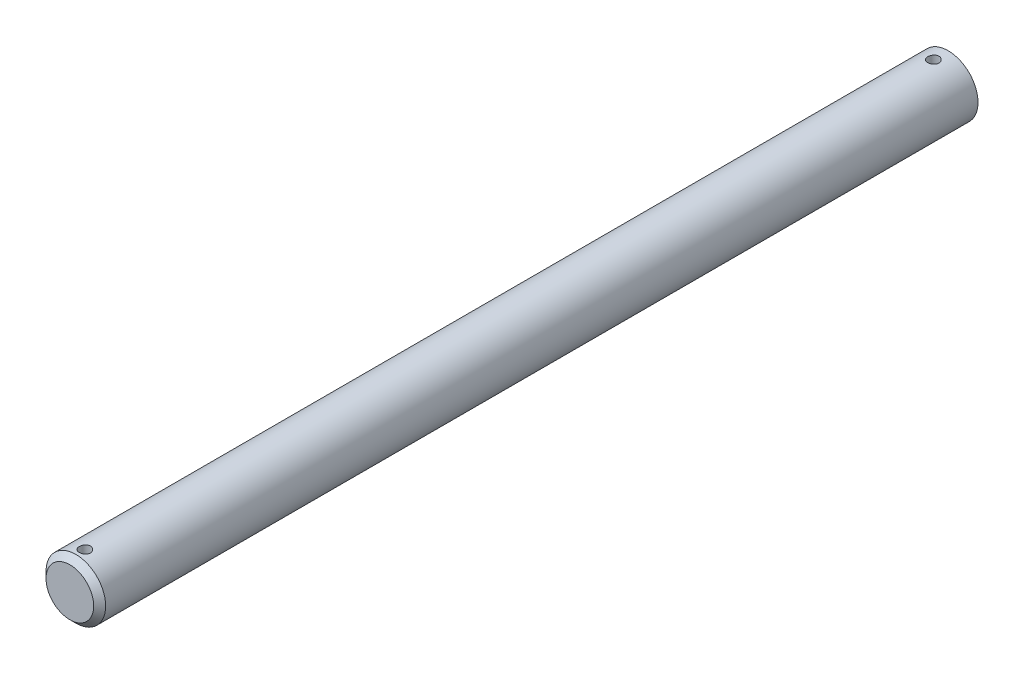
ISO-10303-21;
HEADER;
FILE_DESCRIPTION(('STEP AP214'),'2;1');
FILE_NAME('part.step','',(''),(''),'','','');
FILE_SCHEMA(('AUTOMOTIVE_DESIGN { 1 0 10303 214 1 1 1 1 }'));
ENDSEC;
DATA;
#1=APPLICATION_CONTEXT('core data for automotive mechanical design processes');
#2=APPLICATION_PROTOCOL_DEFINITION('international standard','automotive_design',2000,#1);
#3=PRODUCT_CONTEXT('',#1,'mechanical');
#4=PRODUCT('Part','Part','',(#3));
#5=PRODUCT_RELATED_PRODUCT_CATEGORY('part','',(#4));
#6=PRODUCT_DEFINITION_FORMATION('','',#4);
#7=PRODUCT_DEFINITION_CONTEXT('part definition',#1,'design');
#8=PRODUCT_DEFINITION('design','',#6,#7);
#9=PRODUCT_DEFINITION_SHAPE('','',#8);
#10=(LENGTH_UNIT() NAMED_UNIT(*) SI_UNIT(.MILLI.,.METRE.));
#11=(NAMED_UNIT(*) PLANE_ANGLE_UNIT() SI_UNIT($,.RADIAN.));
#12=(NAMED_UNIT(*) SI_UNIT($,.STERADIAN.) SOLID_ANGLE_UNIT());
#13=UNCERTAINTY_MEASURE_WITH_UNIT(LENGTH_MEASURE(1.E-05),#10,'distance_accuracy_value','');
#14=(GEOMETRIC_REPRESENTATION_CONTEXT(3) GLOBAL_UNCERTAINTY_ASSIGNED_CONTEXT((#13)) GLOBAL_UNIT_ASSIGNED_CONTEXT((#10,
#11,#12)) REPRESENTATION_CONTEXT('',''));
#15=CARTESIAN_POINT('',(0.,0.,0.));
#16=DIRECTION('',(0.,0.,1.));
#17=DIRECTION('',(1.,0.,0.));
#18=AXIS2_PLACEMENT_3D('',#15,#16,#17);
#19=CARTESIAN_POINT('',(0.,0.,304.8));
#20=DIRECTION('',(0.,0.,-1.));
#21=DIRECTION('',(-1.,0.,0.));
#22=AXIS2_PLACEMENT_3D('',#19,#20,#21);
#23=CYLINDRICAL_SURFACE('',#22,3.175);
#24=CARTESIAN_POINT('',(0.,-3.17500000000001,213.4631875));
#25=CARTESIAN_POINT('',(0.0331278493784859,-3.17499940005936,213.463186234132));
#26=CARTESIAN_POINT('',(0.0662721689897613,-3.17447616437681,213.460412916467));
#27=CARTESIAN_POINT('',(0.131626820280968,-3.17243930650301,213.449400064437));
#28=CARTESIAN_POINT('',(0.163836339741669,-3.17092484847488,213.441155916777));
#29=CARTESIAN_POINT('',(0.226366769234938,-3.16707495697542,213.419462709188));
#30=CARTESIAN_POINT('',(0.25668935624075,-3.16474026510011,213.406018349808));
#31=CARTESIAN_POINT('',(0.314645664321689,-3.1595048514429,213.374319695721));
#32=CARTESIAN_POINT('',(0.342279602808194,-3.1566041754851,213.356065790371));
#33=CARTESIAN_POINT('',(0.394407912259928,-3.15051811645857,213.315034154574));
#34=CARTESIAN_POINT('',(0.418865429028271,-3.14733001333615,213.292210001647));
#35=CARTESIAN_POINT('',(0.463627811849759,-3.14104860763278,213.242785624206));
#36=CARTESIAN_POINT('',(0.483932379579189,-3.13795531187579,213.216185128654));
#37=CARTESIAN_POINT('',(0.51996577595488,-3.13218731275362,213.159702708681));
#38=CARTESIAN_POINT('',(0.535657115316888,-3.12951611636079,213.12979647803));
#39=CARTESIAN_POINT('',(0.561778643443762,-3.12493308056008,213.067713899289));
#40=CARTESIAN_POINT('',(0.572209285923869,-3.1230211756692,213.035537747243));
#41=CARTESIAN_POINT('',(0.587395056092026,-3.120200569874,212.970223017731));
#42=CARTESIAN_POINT('',(0.592214454824667,-3.11928051754792,212.937099883297));
#43=CARTESIAN_POINT('',(0.59624042587842,-3.11851356370003,212.870503350404));
#44=CARTESIAN_POINT('',(0.595447501537279,-3.11866656594196,212.837029983624));
#45=CARTESIAN_POINT('',(0.588323450296888,-3.12001809916009,212.77114881341));
#46=CARTESIAN_POINT('',(0.582065407796817,-3.12120283233474,212.738732782137));
#47=CARTESIAN_POINT('',(0.564303860103714,-3.12446266491103,212.675419033399));
#48=CARTESIAN_POINT('',(0.552800132013031,-3.12653780214715,212.644521380514));
#49=CARTESIAN_POINT('',(0.524802287242863,-3.13135905069247,212.584907618022));
#50=CARTESIAN_POINT('',(0.50827865995695,-3.13410911079899,212.556205700738));
#51=CARTESIAN_POINT('',(0.470730932942599,-3.13996773104909,212.501954373361));
#52=CARTESIAN_POINT('',(0.44970637646678,-3.14307632756161,212.476405283626));
#53=CARTESIAN_POINT('',(0.403359563188534,-3.14936188004891,212.428762595718));
#54=CARTESIAN_POINT('',(0.377974795254099,-3.15253914125163,212.406729803558));
#55=CARTESIAN_POINT('',(0.32383731472362,-3.15855900111739,212.367226220107));
#56=CARTESIAN_POINT('',(0.295084568364031,-3.16140159642489,212.349755474555));
#57=CARTESIAN_POINT('',(0.234963886209654,-3.16643757934512,212.319862953933));
#58=CARTESIAN_POINT('',(0.20359273338972,-3.16863015282215,212.307447503288));
#59=CARTESIAN_POINT('',(0.13915989892387,-3.17211275581705,212.288079481804));
#60=CARTESIAN_POINT('',(0.106098397260255,-3.17340288121049,212.281126330644));
#61=CARTESIAN_POINT('',(0.0397464966210355,-3.17492205629787,212.27296491894));
#62=CARTESIAN_POINT('',(0.0064666862641764,-3.17516649268312,212.271673344612));
#63=CARTESIAN_POINT('',(-0.0598333703365833,-3.17460925115548,212.274648268445));
#64=CARTESIAN_POINT('',(-0.0928536292531519,-3.1738076246401,212.278914493529));
#65=CARTESIAN_POINT('',(-0.157432999370982,-3.17125791126725,212.292814648338));
#66=CARTESIAN_POINT('',(-0.189001503602659,-3.16951726067194,212.302406421507));
#67=CARTESIAN_POINT('',(-0.250082300755404,-3.16528387378086,212.326639777378));
#68=CARTESIAN_POINT('',(-0.279594453904932,-3.16279108642312,212.34128170294));
#69=CARTESIAN_POINT('',(-0.336080366506809,-3.157291557982,212.375384132113));
#70=CARTESIAN_POINT('',(-0.363022863065383,-3.1542794982553,212.394895543107));
#71=CARTESIAN_POINT('',(-0.413281147045625,-3.1480892694748,212.438114198266));
#72=CARTESIAN_POINT('',(-0.43659659543635,-3.14491108492986,212.461821834222));
#73=CARTESIAN_POINT('',(-0.479255517992203,-3.13869576292426,212.513137139068));
#74=CARTESIAN_POINT('',(-0.498542136242496,-3.1356610588829,212.540792416662));
#75=CARTESIAN_POINT('',(-0.532196179135613,-3.1301252865148,212.598999182233));
#76=CARTESIAN_POINT('',(-0.546563786592779,-3.12762419835761,212.629550562522));
#77=CARTESIAN_POINT('',(-0.569891360504029,-3.12345793983175,212.692537953562));
#78=CARTESIAN_POINT('',(-0.578877385529318,-3.12178874798387,212.724964035013));
#79=CARTESIAN_POINT('',(-0.591267071076007,-3.11946609009084,212.790899991438));
#80=CARTESIAN_POINT('',(-0.594671361418134,-3.11881250944861,212.824409743701));
#81=CARTESIAN_POINT('',(-0.595779868526295,-3.11860088672157,212.890992306541));
#82=CARTESIAN_POINT('',(-0.593573770795147,-3.11902560714798,212.924063602442));
#83=CARTESIAN_POINT('',(-0.583720477284632,-3.12088450886938,212.989355033124));
#84=CARTESIAN_POINT('',(-0.576073314010797,-3.12231868413375,213.021575172988));
#85=CARTESIAN_POINT('',(-0.555592803846087,-3.126027641217,213.084201436153));
#86=CARTESIAN_POINT('',(-0.542769168607854,-3.12830084823627,213.11461083469));
#87=CARTESIAN_POINT('',(-0.512309542245323,-3.13343285059637,213.172860838402));
#88=CARTESIAN_POINT('',(-0.494673211138131,-3.13629168730423,213.20070126191));
#89=CARTESIAN_POINT('',(-0.454777027878801,-3.14232633736512,213.253472273017));
#90=CARTESIAN_POINT('',(-0.432451906336469,-3.1455062556199,213.278353054363));
#91=CARTESIAN_POINT('',(-0.383947958425857,-3.15179405961499,213.324045173853));
#92=CARTESIAN_POINT('',(-0.357768247938248,-3.15490192863972,213.344855575827));
#93=CARTESIAN_POINT('',(-0.30201590007541,-3.1607282796232,213.381991221824));
#94=CARTESIAN_POINT('',(-0.272414837535462,-3.1634430039313,213.398274398182));
#95=CARTESIAN_POINT('',(-0.210855763856366,-3.16814048941711,213.425610437028));
#96=CARTESIAN_POINT('',(-0.178899999270519,-3.17012393770744,213.436668212109));
#97=CARTESIAN_POINT('',(-0.122375296121231,-3.17273102874592,213.45099443416));
#98=CARTESIAN_POINT('',(-0.0981367934437096,-3.17357708754789,213.455559018905));
#99=CARTESIAN_POINT('',(-0.0492685574488275,-3.17471178919249,213.461655984027));
#100=CARTESIAN_POINT('',(-0.0246388340934183,-3.1750004462058,213.463188441489));
#101=CARTESIAN_POINT('',(0.,-3.17500000000001,213.4631875));
#102=B_SPLINE_CURVE_WITH_KNOTS('',3,(#24,#25,#26,#27,#28,#29,#30,#31,#32,#33,#34,#35,#36,#37,
#38,#39,#40,#41,#42,#43,#44,#45,#46,#47,#48,#49,#50,#51,#52,#53,#54,#55,#56,#57,#58,#59,#60,#61,
#62,#63,#64,#65,#66,#67,#68,#69,#70,#71,#72,#73,#74,#75,#76,#77,#78,#79,#80,#81,#82,#83,#84,#85,
#86,#87,#88,#89,#90,#91,#92,#93,#94,#95,#96,#97,#98,#99,#100,#101),.UNSPECIFIED.,.T.,.F.,(4,2,2,
2,2,2,2,2,2,2,2,2,2,2,2,2,2,2,2,2,2,2,2,2,2,2,2,2,2,2,2,2,2,2,2,2,2,2,4),(0.,0.0992934422579594,
0.198670720631257,0.297958379519775,0.397238003055786,0.497582499616611,0.59793420181311,
0.699080193564204,0.800217460363053,0.900184538548684,1.00014265136194,1.0987841586819,
1.19742985782943,1.29666707356097,1.3959143645104,1.4967258310918,1.59753830838152,
1.69847652240176,1.79940401117395,1.89884119086454,1.99827348496884,2.09692967832173,
2.19559257087285,2.29533361900781,2.39508398463951,2.49615895304341,2.59723016460249,
2.69780792915495,2.79837434413153,2.89734328229484,2.99631162921166,3.09509515682433,
3.19388566460125,3.29415524955412,3.39444786907214,3.49564344413668,3.59674369125816,
3.67059505483131,3.74444454087574),.UNSPECIFIED.);
#103=CARTESIAN_POINT('',(0.,-3.17500000000001,213.4631875));
#104=VERTEX_POINT('',#103);
#105=EDGE_CURVE('E10',#104,#104,#102,.T.);
#106=ORIENTED_EDGE('',*,*,#105,.T.);
#107=EDGE_LOOP('',(#106));
#108=FACE_BOUND('',#107,.T.);
#109=CARTESIAN_POINT('',(0.,3.17499999999999,213.4631875));
#110=CARTESIAN_POINT('',(-0.0331278493784851,3.17499940005934,213.463186234132));
#111=CARTESIAN_POINT('',(-0.0662721689897604,3.1744761643768,213.460412916467));
#112=CARTESIAN_POINT('',(-0.131626820280967,3.17243930650299,213.449400064437));
#113=CARTESIAN_POINT('',(-0.163836339741668,3.17092484847486,213.441155916777));
#114=CARTESIAN_POINT('',(-0.226366769234937,3.1670749569754,213.419462709188));
#115=CARTESIAN_POINT('',(-0.256689356240749,3.16474026510009,213.406018349808));
#116=CARTESIAN_POINT('',(-0.314645664321688,3.15950485144288,213.374319695721));
#117=CARTESIAN_POINT('',(-0.342279602808193,3.15660417548508,213.356065790371));
#118=CARTESIAN_POINT('',(-0.394407912259927,3.15051811645855,213.315034154574));
#119=CARTESIAN_POINT('',(-0.41886542902827,3.14733001333613,213.292210001647));
#120=CARTESIAN_POINT('',(-0.463627811849758,3.14104860763276,213.242785624206));
#121=CARTESIAN_POINT('',(-0.483932379579188,3.13795531187577,213.216185128654));
#122=CARTESIAN_POINT('',(-0.519965775954879,3.1321873127536,213.159702708681));
#123=CARTESIAN_POINT('',(-0.535657115316888,3.12951611636077,213.12979647803));
#124=CARTESIAN_POINT('',(-0.561778643443761,3.12493308056006,213.067713899289));
#125=CARTESIAN_POINT('',(-0.572209285923868,3.12302117566918,213.035537747243));
#126=CARTESIAN_POINT('',(-0.587395056092025,3.12020056987398,212.970223017731));
#127=CARTESIAN_POINT('',(-0.592214454824666,3.11928051754791,212.937099883297));
#128=CARTESIAN_POINT('',(-0.596240425878419,3.11851356370001,212.870503350404));
#129=CARTESIAN_POINT('',(-0.595447501537279,3.11866656594194,212.837029983624));
#130=CARTESIAN_POINT('',(-0.588323450296887,3.12001809916007,212.77114881341));
#131=CARTESIAN_POINT('',(-0.582065407796816,3.12120283233472,212.738732782137));
#132=CARTESIAN_POINT('',(-0.564303860103713,3.12446266491101,212.675419033399));
#133=CARTESIAN_POINT('',(-0.55280013201303,3.12653780214713,212.644521380514));
#134=CARTESIAN_POINT('',(-0.524802287242862,3.13135905069245,212.584907618022));
#135=CARTESIAN_POINT('',(-0.508278659956949,3.13410911079897,212.556205700738));
#136=CARTESIAN_POINT('',(-0.470730932942598,3.13996773104907,212.501954373361));
#137=CARTESIAN_POINT('',(-0.449706376466779,3.14307632756159,212.476405283626));
#138=CARTESIAN_POINT('',(-0.403359563188533,3.14936188004889,212.428762595718));
#139=CARTESIAN_POINT('',(-0.377974795254099,3.15253914125161,212.406729803558));
#140=CARTESIAN_POINT('',(-0.323837314723619,3.15855900111738,212.367226220107));
#141=CARTESIAN_POINT('',(-0.29508456836403,3.16140159642487,212.349755474555));
#142=CARTESIAN_POINT('',(-0.234963886209653,3.1664375793451,212.319862953933));
#143=CARTESIAN_POINT('',(-0.203592733389719,3.16863015282214,212.307447503288));
#144=CARTESIAN_POINT('',(-0.139159898923869,3.17211275581703,212.288079481804));
#145=CARTESIAN_POINT('',(-0.106098397260254,3.17340288121047,212.281126330644));
#146=CARTESIAN_POINT('',(-0.0397464966210345,3.17492205629785,212.27296491894));
#147=CARTESIAN_POINT('',(-0.00646668626417531,3.1751664926831,212.271673344612));
#148=CARTESIAN_POINT('',(0.0598333703365844,3.17460925115546,212.274648268445));
#149=CARTESIAN_POINT('',(0.0928536292531529,3.17380762464008,212.278914493529));
#150=CARTESIAN_POINT('',(0.157432999370982,3.17125791126723,212.292814648338));
#151=CARTESIAN_POINT('',(0.18900150360266,3.16951726067193,212.302406421507));
#152=CARTESIAN_POINT('',(0.250082300755404,3.16528387378084,212.326639777378));
#153=CARTESIAN_POINT('',(0.279594453904933,3.1627910864231,212.34128170294));
#154=CARTESIAN_POINT('',(0.33608036650681,3.15729155798198,212.375384132113));
#155=CARTESIAN_POINT('',(0.363022863065383,3.15427949825529,212.394895543107));
#156=CARTESIAN_POINT('',(0.413281147045626,3.14808926947478,212.438114198266));
#157=CARTESIAN_POINT('',(0.436596595436351,3.14491108492984,212.461821834222));
#158=CARTESIAN_POINT('',(0.479255517992204,3.13869576292424,212.513137139068));
#159=CARTESIAN_POINT('',(0.498542136242497,3.13566105888288,212.540792416662));
#160=CARTESIAN_POINT('',(0.532196179135614,3.13012528651479,212.598999182233));
#161=CARTESIAN_POINT('',(0.54656378659278,3.12762419835759,212.629550562522));
#162=CARTESIAN_POINT('',(0.569891360504029,3.12345793983173,212.692537953562));
#163=CARTESIAN_POINT('',(0.578877385529319,3.12178874798385,212.724964035013));
#164=CARTESIAN_POINT('',(0.591267071076008,3.11946609009082,212.790899991438));
#165=CARTESIAN_POINT('',(0.594671361418135,3.11881250944859,212.824409743701));
#166=CARTESIAN_POINT('',(0.595779868526295,3.11860088672155,212.890992306541));
#167=CARTESIAN_POINT('',(0.593573770795148,3.11902560714797,212.924063602442));
#168=CARTESIAN_POINT('',(0.583720477284633,3.12088450886936,212.989355033124));
#169=CARTESIAN_POINT('',(0.576073314010798,3.12231868413373,213.021575172988));
#170=CARTESIAN_POINT('',(0.555592803846088,3.12602764121698,213.084201436153));
#171=CARTESIAN_POINT('',(0.542769168607855,3.12830084823626,213.11461083469));
#172=CARTESIAN_POINT('',(0.512309542245323,3.13343285059635,213.172860838402));
#173=CARTESIAN_POINT('',(0.494673211138132,3.13629168730421,213.20070126191));
#174=CARTESIAN_POINT('',(0.454777027878801,3.1423263373651,213.253472273017));
#175=CARTESIAN_POINT('',(0.43245190633647,3.14550625561988,213.278353054363));
#176=CARTESIAN_POINT('',(0.383947958425858,3.15179405961497,213.324045173853));
#177=CARTESIAN_POINT('',(0.357768247938248,3.1549019286397,213.344855575827));
#178=CARTESIAN_POINT('',(0.302015900075414,3.16072827962318,213.381991221824));
#179=CARTESIAN_POINT('',(0.27241483753547,3.16344300393128,213.398274398182));
#180=CARTESIAN_POINT('',(0.210855763856375,3.16814048941709,213.425610437028));
#181=CARTESIAN_POINT('',(0.178899999270524,3.17012393770742,213.436668212109));
#182=CARTESIAN_POINT('',(0.122375296121231,3.17273102874591,213.45099443416));
#183=CARTESIAN_POINT('',(0.0981367934437104,3.17357708754787,213.455559018905));
#184=CARTESIAN_POINT('',(0.0492685574488284,3.17471178919247,213.461655984027));
#185=CARTESIAN_POINT('',(0.0246388340934192,3.17500044620578,213.463188441489));
#186=CARTESIAN_POINT('',(0.,3.17499999999999,213.4631875));
#187=B_SPLINE_CURVE_WITH_KNOTS('',3,(#109,#110,#111,#112,#113,#114,#115,#116,#117,#118,#119,
#120,#121,#122,#123,#124,#125,#126,#127,#128,#129,#130,#131,#132,#133,#134,#135,#136,#137,#138,
#139,#140,#141,#142,#143,#144,#145,#146,#147,#148,#149,#150,#151,#152,#153,#154,#155,#156,#157,
#158,#159,#160,#161,#162,#163,#164,#165,#166,#167,#168,#169,#170,#171,#172,#173,#174,#175,#176,
#177,#178,#179,#180,#181,#182,#183,#184,#185,#186),.UNSPECIFIED.,.T.,.F.,(4,2,2,2,2,2,2,2,2,2,2,
2,2,2,2,2,2,2,2,2,2,2,2,2,2,2,2,2,2,2,2,2,2,2,2,2,2,2,4),(0.,0.0992934422579594,
0.198670720631257,0.297958379519775,0.397238003055786,0.497582499616611,0.59793420181311,
0.699080193564204,0.800217460363053,0.900184538548684,1.00014265136194,1.0987841586819,
1.19742985782943,1.29666707356097,1.3959143645104,1.4967258310918,1.59753830838152,
1.69847652240176,1.79940401117395,1.89884119086454,1.99827348496884,2.09692967832173,
2.19559257087285,2.29533361900781,2.39508398463951,2.49615895304341,2.59723016460249,
2.69780792915495,2.79837434413153,2.89734328229484,2.99631162921166,3.09509515682433,
3.19388566460125,3.29415524955412,3.39444786907214,3.49564344413668,3.59674369125816,
3.67059505483131,3.74444454087574),.UNSPECIFIED.);
#188=CARTESIAN_POINT('',(0.,3.17499999999999,213.4631875));
#189=VERTEX_POINT('',#188);
#190=EDGE_CURVE('E50',#189,#189,#187,.T.);
#191=ORIENTED_EDGE('',*,*,#190,.T.);
#192=EDGE_LOOP('',(#191));
#193=FACE_BOUND('',#192,.T.);
#194=CARTESIAN_POINT('',(0.,-3.17500000000001,303.8078125));
#195=CARTESIAN_POINT('',(0.0331278493784956,-3.17499940005936,303.807811234132));
#196=CARTESIAN_POINT('',(0.0662721689897699,-3.17447616437681,303.805037916467));
#197=CARTESIAN_POINT('',(0.131626820280976,-3.17243930650301,303.794025064437));
#198=CARTESIAN_POINT('',(0.163836339741677,-3.17092484847488,303.785780916777));
#199=CARTESIAN_POINT('',(0.226366769234958,-3.16707495697542,303.764087709188));
#200=CARTESIAN_POINT('',(0.256689356240781,-3.16474026510011,303.750643349808));
#201=CARTESIAN_POINT('',(0.314645664321714,-3.15950485144289,303.718944695721));
#202=CARTESIAN_POINT('',(0.342279602808203,-3.15660417548509,303.700690790371));
#203=CARTESIAN_POINT('',(0.394407912259931,-3.15051811645857,303.659659154574));
#204=CARTESIAN_POINT('',(0.41886542902828,-3.14733001333615,303.636835001646));
#205=CARTESIAN_POINT('',(0.463627811849776,-3.14104860763277,303.587410624206));
#206=CARTESIAN_POINT('',(0.483932379579207,-3.13795531187578,303.560810128654));
#207=CARTESIAN_POINT('',(0.519965775954901,-3.13218731275362,303.504327708681));
#208=CARTESIAN_POINT('',(0.535657115316909,-3.12951611636079,303.47442147803));
#209=CARTESIAN_POINT('',(0.561778643443776,-3.12493308056008,303.412338899289));
#210=CARTESIAN_POINT('',(0.572209285923881,-3.1230211756692,303.380162747243));
#211=CARTESIAN_POINT('',(0.587395056092034,-3.120200569874,303.314848017731));
#212=CARTESIAN_POINT('',(0.592214454824669,-3.11928051754792,303.281724883297));
#213=CARTESIAN_POINT('',(0.596240425878417,-3.11851356370003,303.215128350404));
#214=CARTESIAN_POINT('',(0.595447501537278,-3.11866656594196,303.181654983624));
#215=CARTESIAN_POINT('',(0.58832345029689,-3.12001809916009,303.11577381341));
#216=CARTESIAN_POINT('',(0.582065407796815,-3.12120283233474,303.083357782137));
#217=CARTESIAN_POINT('',(0.564303860103707,-3.12446266491103,303.020044033399));
#218=CARTESIAN_POINT('',(0.552800132013023,-3.12653780214715,302.989146380513));
#219=CARTESIAN_POINT('',(0.524802287242861,-3.13135905069247,302.929532618022));
#220=CARTESIAN_POINT('',(0.508278659956958,-3.13410911079899,302.900830700738));
#221=CARTESIAN_POINT('',(0.470730932942623,-3.13996773104909,302.846579373361));
#222=CARTESIAN_POINT('',(0.449706376466809,-3.14307632756161,302.821030283626));
#223=CARTESIAN_POINT('',(0.403359563188558,-3.14936188004891,302.773387595718));
#224=CARTESIAN_POINT('',(0.377974795254109,-3.15253914125163,302.751354803558));
#225=CARTESIAN_POINT('',(0.323837314723599,-3.1585590011174,302.711851220107));
#226=CARTESIAN_POINT('',(0.295084568363997,-3.16140159642489,302.694380474555));
#227=CARTESIAN_POINT('',(0.234963886209613,-3.16643757934512,302.664487953933));
#228=CARTESIAN_POINT('',(0.203592733389688,-3.16863015282216,302.652072503288));
#229=CARTESIAN_POINT('',(0.139159898923856,-3.17211275581705,302.632704481804));
#230=CARTESIAN_POINT('',(0.106098397260251,-3.17340288121049,302.625751330645));
#231=CARTESIAN_POINT('',(0.0397464966210445,-3.17492205629787,302.61758991894));
#232=CARTESIAN_POINT('',(0.00646668626418795,-3.17516649268312,302.616298344612));
#233=CARTESIAN_POINT('',(-0.0598333703365708,-3.17460925115548,302.619273268446));
#234=CARTESIAN_POINT('',(-0.0928536292531409,-3.1738076246401,302.623539493529));
#235=CARTESIAN_POINT('',(-0.157432999370963,-3.17125791126725,302.637439648338));
#236=CARTESIAN_POINT('',(-0.189001503602631,-3.16951726067195,302.647031421507));
#237=CARTESIAN_POINT('',(-0.250082300755378,-3.16528387378086,302.671264777378));
#238=CARTESIAN_POINT('',(-0.279594453904919,-3.16279108642312,302.68590670294));
#239=CARTESIAN_POINT('',(-0.33608036650679,-3.157291557982,302.720009132113));
#240=CARTESIAN_POINT('',(-0.363022863065345,-3.15427949825531,302.739520543107));
#241=CARTESIAN_POINT('',(-0.413281147045584,-3.14808926947481,302.782739198266));
#242=CARTESIAN_POINT('',(-0.436596595436325,-3.14491108492986,302.806446834222));
#243=CARTESIAN_POINT('',(-0.479255517992183,-3.13869576292427,302.857762139068));
#244=CARTESIAN_POINT('',(-0.498542136242465,-3.13566105888291,302.885417416662));
#245=CARTESIAN_POINT('',(-0.532196179135576,-3.13012528651481,302.943624182233));
#246=CARTESIAN_POINT('',(-0.546563786592745,-3.12762419835762,302.974175562522));
#247=CARTESIAN_POINT('',(-0.569891360503998,-3.12345793983176,303.037162953562));
#248=CARTESIAN_POINT('',(-0.578877385529289,-3.12178874798387,303.069589035013));
#249=CARTESIAN_POINT('',(-0.591267071075983,-3.11946609009085,303.135524991438));
#250=CARTESIAN_POINT('',(-0.594671361418111,-3.11881250944861,303.169034743701));
#251=CARTESIAN_POINT('',(-0.595779868526272,-3.11860088672157,303.235617306541));
#252=CARTESIAN_POINT('',(-0.593573770795127,-3.11902560714799,303.268688602442));
#253=CARTESIAN_POINT('',(-0.583720477284618,-3.12088450886938,303.333980033124));
#254=CARTESIAN_POINT('',(-0.57607331401078,-3.12231868413375,303.366200172988));
#255=CARTESIAN_POINT('',(-0.555592803846065,-3.12602764121701,303.428826436153));
#256=CARTESIAN_POINT('',(-0.542769168607834,-3.12830084823628,303.45923583469));
#257=CARTESIAN_POINT('',(-0.512309542245301,-3.13343285059638,303.517485838402));
#258=CARTESIAN_POINT('',(-0.4946732111381,-3.13629168730423,303.54532626191));
#259=CARTESIAN_POINT('',(-0.454777027878766,-3.14232633736512,303.598097273017));
#260=CARTESIAN_POINT('',(-0.432451906336444,-3.1455062556199,303.622978054363));
#261=CARTESIAN_POINT('',(-0.383947958425829,-3.15179405961499,303.668670173853));
#262=CARTESIAN_POINT('',(-0.357768247938207,-3.15490192863972,303.689480575826));
#263=CARTESIAN_POINT('',(-0.302015900075373,-3.16072827962321,303.726616221824));
#264=CARTESIAN_POINT('',(-0.272414837535442,-3.1634430039313,303.742899398182));
#265=CARTESIAN_POINT('',(-0.21085576385636,-3.16814048941711,303.770235437028));
#266=CARTESIAN_POINT('',(-0.178899999270509,-3.17012393770744,303.781293212109));
#267=CARTESIAN_POINT('',(-0.122375296121215,-3.17273102874592,303.79561943416));
#268=CARTESIAN_POINT('',(-0.0981367934436929,-3.17357708754789,303.800184018905));
#269=CARTESIAN_POINT('',(-0.0492685574488116,-3.17471178919249,303.806280984027));
#270=CARTESIAN_POINT('',(-0.0246388340934046,-3.1750004462058,303.807813441489));
#271=CARTESIAN_POINT('',(0.,-3.17500000000001,303.8078125));
#272=B_SPLINE_CURVE_WITH_KNOTS('',3,(#194,#195,#196,#197,#198,#199,#200,#201,#202,#203,#204,
#205,#206,#207,#208,#209,#210,#211,#212,#213,#214,#215,#216,#217,#218,#219,#220,#221,#222,#223,
#224,#225,#226,#227,#228,#229,#230,#231,#232,#233,#234,#235,#236,#237,#238,#239,#240,#241,#242,
#243,#244,#245,#246,#247,#248,#249,#250,#251,#252,#253,#254,#255,#256,#257,#258,#259,#260,#261,
#262,#263,#264,#265,#266,#267,#268,#269,#270,#271),.UNSPECIFIED.,.T.,.F.,(4,2,2,2,2,2,2,2,2,2,2,
2,2,2,2,2,2,2,2,2,2,2,2,2,2,2,2,2,2,2,2,2,2,2,2,2,2,2,4),(0.,0.0992934422579537,
0.198670720631256,0.297958379519797,0.397238003055775,0.497582499616633,0.597934201813132,
0.699080193564254,0.800217460363045,0.900184538548675,1.00014265136191,1.09878415868192,
1.19742985782948,1.29666707356095,1.39591436451032,1.49672583109181,1.59753830838155,
1.69847652240177,1.79940401117393,1.89884119086451,1.99827348496881,2.09692967832168,
2.1955925708728,2.29533361900778,2.39508398463947,2.49615895304333,2.59723016460242,
2.69780792915486,2.79837434413146,2.89734328229474,2.99631162921161,3.09509515682426,
3.19388566460124,3.29415524955408,3.39444786907209,3.49564344413663,3.5967436912581,
3.67059505483126,3.74444454087568),.UNSPECIFIED.);
#273=CARTESIAN_POINT('',(0.,-3.17500000000001,303.8078125));
#274=VERTEX_POINT('',#273);
#275=EDGE_CURVE('E56',#274,#274,#272,.T.);
#276=ORIENTED_EDGE('',*,*,#275,.T.);
#277=EDGE_LOOP('',(#276));
#278=FACE_BOUND('',#277,.T.);
#279=CARTESIAN_POINT('',(0.,3.17499999999999,303.8078125));
#280=CARTESIAN_POINT('',(-0.0331278493784698,3.17499940005934,303.807811234132));
#281=CARTESIAN_POINT('',(-0.0662721689897442,3.17447616437679,303.805037916467));
#282=CARTESIAN_POINT('',(-0.13162682028095,3.17243930650299,303.794025064437));
#283=CARTESIAN_POINT('',(-0.163836339741651,3.17092484847486,303.785780916777));
#284=CARTESIAN_POINT('',(-0.226366769234933,3.1670749569754,303.764087709188));
#285=CARTESIAN_POINT('',(-0.256689356240756,3.16474026510009,303.750643349808));
#286=CARTESIAN_POINT('',(-0.314645664321688,3.15950485144288,303.718944695721));
#287=CARTESIAN_POINT('',(-0.342279602808177,3.15660417548508,303.700690790371));
#288=CARTESIAN_POINT('',(-0.394407912259905,3.15051811645856,303.659659154574));
#289=CARTESIAN_POINT('',(-0.418865429028254,3.14733001333614,303.636835001646));
#290=CARTESIAN_POINT('',(-0.46362781184975,3.14104860763276,303.587410624206));
#291=CARTESIAN_POINT('',(-0.483932379579181,3.13795531187577,303.560810128654));
#292=CARTESIAN_POINT('',(-0.519965775954875,3.1321873127536,303.504327708681));
#293=CARTESIAN_POINT('',(-0.535657115316883,3.12951611636077,303.47442147803));
#294=CARTESIAN_POINT('',(-0.56177864344375,3.12493308056007,303.412338899289));
#295=CARTESIAN_POINT('',(-0.572209285923855,3.12302117566919,303.380162747243));
#296=CARTESIAN_POINT('',(-0.587395056092009,3.12020056987399,303.314848017731));
#297=CARTESIAN_POINT('',(-0.592214454824643,3.11928051754791,303.281724883297));
#298=CARTESIAN_POINT('',(-0.596240425878392,3.11851356370001,303.215128350404));
#299=CARTESIAN_POINT('',(-0.595447501537253,3.11866656594195,303.181654983624));
#300=CARTESIAN_POINT('',(-0.588323450296865,3.12001809916008,303.11577381341));
#301=CARTESIAN_POINT('',(-0.58206540779679,3.12120283233473,303.083357782137));
#302=CARTESIAN_POINT('',(-0.564303860103681,3.12446266491101,303.020044033399));
#303=CARTESIAN_POINT('',(-0.552800132012997,3.12653780214714,302.989146380513));
#304=CARTESIAN_POINT('',(-0.524802287242835,3.13135905069245,302.929532618022));
#305=CARTESIAN_POINT('',(-0.508278659956932,3.13410911079897,302.900830700738));
#306=CARTESIAN_POINT('',(-0.470730932942597,3.13996773104907,302.846579373361));
#307=CARTESIAN_POINT('',(-0.449706376466783,3.14307632756159,302.821030283626));
#308=CARTESIAN_POINT('',(-0.403359563188532,3.14936188004889,302.773387595718));
#309=CARTESIAN_POINT('',(-0.377974795254083,3.15253914125161,302.751354803558));
#310=CARTESIAN_POINT('',(-0.323837314723573,3.15855900111738,302.711851220107));
#311=CARTESIAN_POINT('',(-0.295084568363971,3.16140159642487,302.694380474555));
#312=CARTESIAN_POINT('',(-0.234963886209588,3.16643757934511,302.664487953933));
#313=CARTESIAN_POINT('',(-0.203592733389662,3.16863015282214,302.652072503288));
#314=CARTESIAN_POINT('',(-0.13915989892383,3.17211275581703,302.632704481804));
#315=CARTESIAN_POINT('',(-0.106098397260226,3.17340288121047,302.625751330645));
#316=CARTESIAN_POINT('',(-0.0397464966210191,3.17492205629785,302.61758991894));
#317=CARTESIAN_POINT('',(-0.00646668626416251,3.1751664926831,302.616298344612));
#318=CARTESIAN_POINT('',(0.0598333703365961,3.17460925115546,302.619273268446));
#319=CARTESIAN_POINT('',(0.0928536292531661,3.17380762464008,302.623539493529));
#320=CARTESIAN_POINT('',(0.157432999370988,3.17125791126723,302.637439648338));
#321=CARTESIAN_POINT('',(0.189001503602656,3.16951726067193,302.647031421507));
#322=CARTESIAN_POINT('',(0.250082300755404,3.16528387378084,302.671264777378));
#323=CARTESIAN_POINT('',(0.279594453904944,3.1627910864231,302.68590670294));
#324=CARTESIAN_POINT('',(0.336080366506815,3.15729155798198,302.720009132113));
#325=CARTESIAN_POINT('',(0.36302286306537,3.15427949825529,302.739520543107));
#326=CARTESIAN_POINT('',(0.413281147045609,3.14808926947478,302.782739198266));
#327=CARTESIAN_POINT('',(0.436596595436351,3.14491108492984,302.806446834222));
#328=CARTESIAN_POINT('',(0.479255517992208,3.13869576292424,302.857762139068));
#329=CARTESIAN_POINT('',(0.49854213624249,3.13566105888288,302.885417416662));
#330=CARTESIAN_POINT('',(0.532196179135601,3.13012528651479,302.943624182233));
#331=CARTESIAN_POINT('',(0.54656378659277,3.1276241983576,302.974175562522));
#332=CARTESIAN_POINT('',(0.569891360504023,3.12345793983173,303.037162953562));
#333=CARTESIAN_POINT('',(0.578877385529315,3.12178874798385,303.069589035013));
#334=CARTESIAN_POINT('',(0.591267071076009,3.11946609009082,303.135524991438));
#335=CARTESIAN_POINT('',(0.594671361418136,3.11881250944859,303.169034743701));
#336=CARTESIAN_POINT('',(0.595779868526297,3.11860088672155,303.235617306541));
#337=CARTESIAN_POINT('',(0.593573770795153,3.11902560714796,303.268688602442));
#338=CARTESIAN_POINT('',(0.583720477284644,3.12088450886935,303.333980033124));
#339=CARTESIAN_POINT('',(0.576073314010806,3.12231868413373,303.366200172988));
#340=CARTESIAN_POINT('',(0.555592803846091,3.12602764121698,303.428826436153));
#341=CARTESIAN_POINT('',(0.54276916860786,3.12830084823626,303.45923583469));
#342=CARTESIAN_POINT('',(0.512309542245326,3.13343285059635,303.517485838402));
#343=CARTESIAN_POINT('',(0.494673211138126,3.13629168730421,303.54532626191));
#344=CARTESIAN_POINT('',(0.454777027878792,3.1423263373651,303.598097273017));
#345=CARTESIAN_POINT('',(0.432451906336469,3.14550625561988,303.622978054363));
#346=CARTESIAN_POINT('',(0.383947958425855,3.15179405961497,303.668670173853));
#347=CARTESIAN_POINT('',(0.357768247938233,3.1549019286397,303.689480575826));
#348=CARTESIAN_POINT('',(0.302015900075392,3.16072827962318,303.726616221824));
#349=CARTESIAN_POINT('',(0.272414837535453,3.16344300393128,303.742899398182));
#350=CARTESIAN_POINT('',(0.210855763856371,3.16814048941709,303.770235437028));
#351=CARTESIAN_POINT('',(0.178899999270528,3.17012393770742,303.781293212109));
#352=CARTESIAN_POINT('',(0.122375296121242,3.1727310287459,303.79561943416));
#353=CARTESIAN_POINT('',(0.0981367934437188,3.17357708754787,303.800184018905));
#354=CARTESIAN_POINT('',(0.0492685574488371,3.17471178919247,303.806280984027));
#355=CARTESIAN_POINT('',(0.0246388340934303,3.17500044620578,303.807813441489));
#356=CARTESIAN_POINT('',(0.,3.17499999999999,303.8078125));
#357=B_SPLINE_CURVE_WITH_KNOTS('',3,(#279,#280,#281,#282,#283,#284,#285,#286,#287,#288,#289,
#290,#291,#292,#293,#294,#295,#296,#297,#298,#299,#300,#301,#302,#303,#304,#305,#306,#307,#308,
#309,#310,#311,#312,#313,#314,#315,#316,#317,#318,#319,#320,#321,#322,#323,#324,#325,#326,#327,
#328,#329,#330,#331,#332,#333,#334,#335,#336,#337,#338,#339,#340,#341,#342,#343,#344,#345,#346,
#347,#348,#349,#350,#351,#352,#353,#354,#355,#356),.UNSPECIFIED.,.T.,.F.,(4,2,2,2,2,2,2,2,2,2,2,
2,2,2,2,2,2,2,2,2,2,2,2,2,2,2,2,2,2,2,2,2,2,2,2,2,2,2,4),(0.,0.0992934422579536,
0.198670720631256,0.297958379519797,0.397238003055775,0.497582499616632,0.597934201813132,
0.699080193564254,0.800217460363045,0.900184538548675,1.00014265136191,1.09878415868192,
1.19742985782948,1.29666707356095,1.39591436451032,1.49672583109181,1.59753830838155,
1.69847652240177,1.79940401117393,1.89884119086451,1.99827348496881,2.09692967832168,
2.1955925708728,2.29533361900778,2.39508398463947,2.49615895304333,2.59723016460242,
2.69780792915486,2.79837434413146,2.89734328229474,2.99631162921161,3.09509515682425,
3.19388566460124,3.29415524955408,3.39444786907209,3.49564344413664,3.5967436912581,
3.67059505483125,3.74444454087568),.UNSPECIFIED.);
#358=CARTESIAN_POINT('',(0.,3.17499999999999,303.8078125));
#359=VERTEX_POINT('',#358);
#360=EDGE_CURVE('E61',#359,#359,#357,.T.);
#361=ORIENTED_EDGE('',*,*,#360,.T.);
#362=EDGE_LOOP('',(#361));
#363=FACE_BOUND('',#362,.T.);
#364=CARTESIAN_POINT('',(0.,0.,211.280375));
#365=DIRECTION('',(0.,0.,1.));
#366=DIRECTION('',(1.,0.,0.));
#367=AXIS2_PLACEMENT_3D('',#364,#365,#366);
#368=CIRCLE('',#367,3.175);
#369=CARTESIAN_POINT('',(3.175,0.,211.280375));
#370=VERTEX_POINT('',#369);
#371=EDGE_CURVE('E99',#370,#370,#368,.T.);
#372=ORIENTED_EDGE('',*,*,#371,.T.);
#373=EDGE_LOOP('',(#372));
#374=FACE_BOUND('',#373,.T.);
#375=CARTESIAN_POINT('',(0.,0.,304.165));
#376=DIRECTION('',(0.,0.,1.));
#377=DIRECTION('',(1.,0.,0.));
#378=AXIS2_PLACEMENT_3D('',#375,#376,#377);
#379=CIRCLE('',#378,3.175);
#380=CARTESIAN_POINT('',(3.175,0.,304.165));
#381=VERTEX_POINT('',#380);
#382=EDGE_CURVE('E95',#381,#381,#379,.F.);
#383=ORIENTED_EDGE('',*,*,#382,.T.);
#384=EDGE_LOOP('',(#383));
#385=FACE_BOUND('',#384,.T.);
#386=ADVANCED_FACE('F38',(#108,#193,#278,#363,#374,#385),#23,.T.);
#387=CARTESIAN_POINT('',(0.,0.,304.8));
#388=DIRECTION('',(0.,0.,1.));
#389=DIRECTION('',(1.,0.,0.));
#390=AXIS2_PLACEMENT_3D('',#387,#388,#389);
#391=PLANE('',#390);
#392=CARTESIAN_POINT('',(0.,0.,304.8));
#393=DIRECTION('',(0.,0.,1.));
#394=DIRECTION('',(1.,0.,0.));
#395=AXIS2_PLACEMENT_3D('',#392,#393,#394);
#396=CIRCLE('',#395,2.54000000000021);
#397=CARTESIAN_POINT('',(2.54000000000021,0.,304.8));
#398=VERTEX_POINT('',#397);
#399=EDGE_CURVE('E91',#398,#398,#396,.T.);
#400=ORIENTED_EDGE('',*,*,#399,.T.);
#401=EDGE_LOOP('',(#400));
#402=FACE_BOUND('',#401,.T.);
#403=ADVANCED_FACE('F109',(#402),#391,.T.);
#404=CARTESIAN_POINT('',(0.,0.,304.8));
#405=DIRECTION('',(0.,0.,-1.));
#406=DIRECTION('',(-1.,0.,0.));
#407=AXIS2_PLACEMENT_3D('',#404,#405,#406);
#408=CONICAL_SURFACE('',#407,2.54000000000021,0.785398163397418);
#409=ORIENTED_EDGE('',*,*,#382,.F.);
#410=EDGE_LOOP('',(#409));
#411=FACE_BOUND('',#410,.T.);
#412=ORIENTED_EDGE('',*,*,#399,.F.);
#413=EDGE_LOOP('',(#412));
#414=FACE_BOUND('',#413,.T.);
#415=ADVANCED_FACE('F40',(#411,#414),#408,.T.);
#416=CARTESIAN_POINT('',(0.,0.,211.280375));
#417=DIRECTION('',(0.,0.,1.));
#418=DIRECTION('',(1.,0.,0.));
#419=AXIS2_PLACEMENT_3D('',#416,#417,#418);
#420=PLANE('',#419);
#421=ORIENTED_EDGE('',*,*,#371,.F.);
#422=EDGE_LOOP('',(#421));
#423=FACE_BOUND('',#422,.T.);
#424=ADVANCED_FACE('F82',(#423),#420,.F.);
#425=CARTESIAN_POINT('',(0.,-3.17500000000001,303.2125));
#426=DIRECTION('',(0.,1.,0.));
#427=DIRECTION('',(0.,0.,1.));
#428=AXIS2_PLACEMENT_3D('',#425,#426,#427);
#429=CYLINDRICAL_SURFACE('',#428,0.595312500000002);
#430=ORIENTED_EDGE('',*,*,#360,.F.);
#431=EDGE_LOOP('',(#430));
#432=FACE_BOUND('',#431,.T.);
#433=ORIENTED_EDGE('',*,*,#275,.F.);
#434=EDGE_LOOP('',(#433));
#435=FACE_BOUND('',#434,.T.);
#436=ADVANCED_FACE('F76',(#432,#435),#429,.F.);
#437=CARTESIAN_POINT('',(0.,-3.17500000000001,212.867875));
#438=DIRECTION('',(0.,1.,0.));
#439=DIRECTION('',(0.,0.,1.));
#440=AXIS2_PLACEMENT_3D('',#437,#438,#439);
#441=CYLINDRICAL_SURFACE('',#440,0.595312500000012);
#442=ORIENTED_EDGE('',*,*,#190,.F.);
#443=EDGE_LOOP('',(#442));
#444=FACE_BOUND('',#443,.T.);
#445=ORIENTED_EDGE('',*,*,#105,.F.);
#446=EDGE_LOOP('',(#445));
#447=FACE_BOUND('',#446,.T.);
#448=ADVANCED_FACE('F73',(#444,#447),#441,.F.);
#449=CLOSED_SHELL('',(#386,#403,#415,#424,#436,#448));
#450=MANIFOLD_SOLID_BREP('B2',#449);
#451=ADVANCED_BREP_SHAPE_REPRESENTATION('',(#18,#450),#14);
#452=SHAPE_DEFINITION_REPRESENTATION(#9,#451);
ENDSEC;
END-ISO-10303-21;
